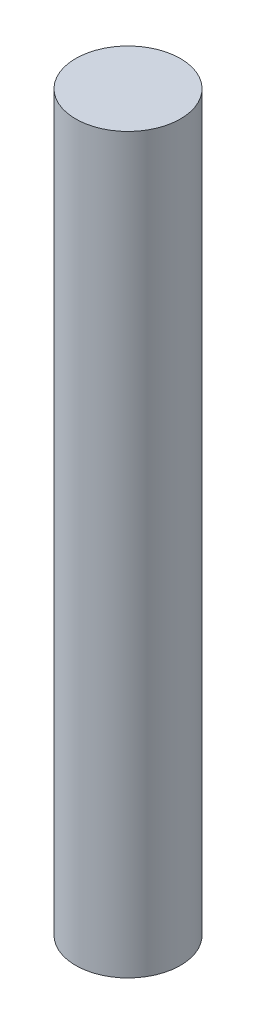
ISO-10303-21;
HEADER;
FILE_DESCRIPTION(('STEP AP214'),'2;1');
FILE_NAME('part.step','',(''),(''),'','','');
FILE_SCHEMA(('AUTOMOTIVE_DESIGN { 1 0 10303 214 1 1 1 1 }'));
ENDSEC;
DATA;
#1=APPLICATION_CONTEXT('core data for automotive mechanical design processes');
#2=APPLICATION_PROTOCOL_DEFINITION('international standard','automotive_design',2000,#1);
#3=PRODUCT_CONTEXT('',#1,'mechanical');
#4=PRODUCT('Part','Part','',(#3));
#5=PRODUCT_RELATED_PRODUCT_CATEGORY('part','',(#4));
#6=PRODUCT_DEFINITION_FORMATION('','',#4);
#7=PRODUCT_DEFINITION_CONTEXT('part definition',#1,'design');
#8=PRODUCT_DEFINITION('design','',#6,#7);
#9=PRODUCT_DEFINITION_SHAPE('','',#8);
#10=(LENGTH_UNIT() NAMED_UNIT(*) SI_UNIT(.MILLI.,.METRE.));
#11=(NAMED_UNIT(*) PLANE_ANGLE_UNIT() SI_UNIT($,.RADIAN.));
#12=(NAMED_UNIT(*) SI_UNIT($,.STERADIAN.) SOLID_ANGLE_UNIT());
#13=UNCERTAINTY_MEASURE_WITH_UNIT(LENGTH_MEASURE(1.E-05),#10,'distance_accuracy_value','');
#14=(GEOMETRIC_REPRESENTATION_CONTEXT(3) GLOBAL_UNCERTAINTY_ASSIGNED_CONTEXT((#13)) GLOBAL_UNIT_ASSIGNED_CONTEXT((#10,
#11,#12)) REPRESENTATION_CONTEXT('',''));
#15=CARTESIAN_POINT('',(0.,0.,0.));
#16=DIRECTION('',(0.,0.,1.));
#17=DIRECTION('',(1.,0.,0.));
#18=AXIS2_PLACEMENT_3D('',#15,#16,#17);
#19=CARTESIAN_POINT('',(0.,21.,0.));
#20=DIRECTION('',(0.,1.,0.));
#21=DIRECTION('',(0.,0.,1.));
#22=AXIS2_PLACEMENT_3D('',#19,#20,#21);
#23=PLANE('',#22);
#24=CARTESIAN_POINT('',(0.,21.,0.));
#25=DIRECTION('',(0.,-1.,0.));
#26=DIRECTION('',(0.,0.,-1.));
#27=AXIS2_PLACEMENT_3D('',#24,#25,#26);
#28=CIRCLE('',#27,1.5);
#29=CARTESIAN_POINT('',(0.,21.,-1.5));
#30=VERTEX_POINT('',#29);
#31=EDGE_CURVE('E10',#30,#30,#28,.T.);
#32=ORIENTED_EDGE('',*,*,#31,.F.);
#33=EDGE_LOOP('',(#32));
#34=FACE_BOUND('',#33,.T.);
#35=ADVANCED_FACE('F30',(#34),#23,.T.);
#36=CARTESIAN_POINT('',(0.,0.,0.));
#37=DIRECTION('',(0.,-1.,0.));
#38=DIRECTION('',(0.,0.,-1.));
#39=AXIS2_PLACEMENT_3D('',#36,#37,#38);
#40=CYLINDRICAL_SURFACE('',#39,1.5);
#41=ORIENTED_EDGE('',*,*,#31,.T.);
#42=EDGE_LOOP('',(#41));
#43=FACE_BOUND('',#42,.T.);
#44=CARTESIAN_POINT('',(0.,0.,0.));
#45=DIRECTION('',(0.,-1.,0.));
#46=DIRECTION('',(0.,0.,-1.));
#47=AXIS2_PLACEMENT_3D('',#44,#45,#46);
#48=CIRCLE('',#47,1.5);
#49=CARTESIAN_POINT('',(0.,0.,-1.5));
#50=VERTEX_POINT('',#49);
#51=EDGE_CURVE('E36',#50,#50,#48,.T.);
#52=ORIENTED_EDGE('',*,*,#51,.F.);
#53=EDGE_LOOP('',(#52));
#54=FACE_BOUND('',#53,.T.);
#55=ADVANCED_FACE('F44',(#43,#54),#40,.T.);
#56=CARTESIAN_POINT('',(0.,0.,0.));
#57=DIRECTION('',(0.,-1.,0.));
#58=DIRECTION('',(0.,0.,-1.));
#59=AXIS2_PLACEMENT_3D('',#56,#57,#58);
#60=PLANE('',#59);
#61=ORIENTED_EDGE('',*,*,#51,.T.);
#62=EDGE_LOOP('',(#61));
#63=FACE_BOUND('',#62,.T.);
#64=ADVANCED_FACE('F42',(#63),#60,.T.);
#65=CLOSED_SHELL('',(#35,#55,#64));
#66=MANIFOLD_SOLID_BREP('B2',#65);
#67=ADVANCED_BREP_SHAPE_REPRESENTATION('',(#18,#66),#14);
#68=SHAPE_DEFINITION_REPRESENTATION(#9,#67);
ENDSEC;
END-ISO-10303-21;
